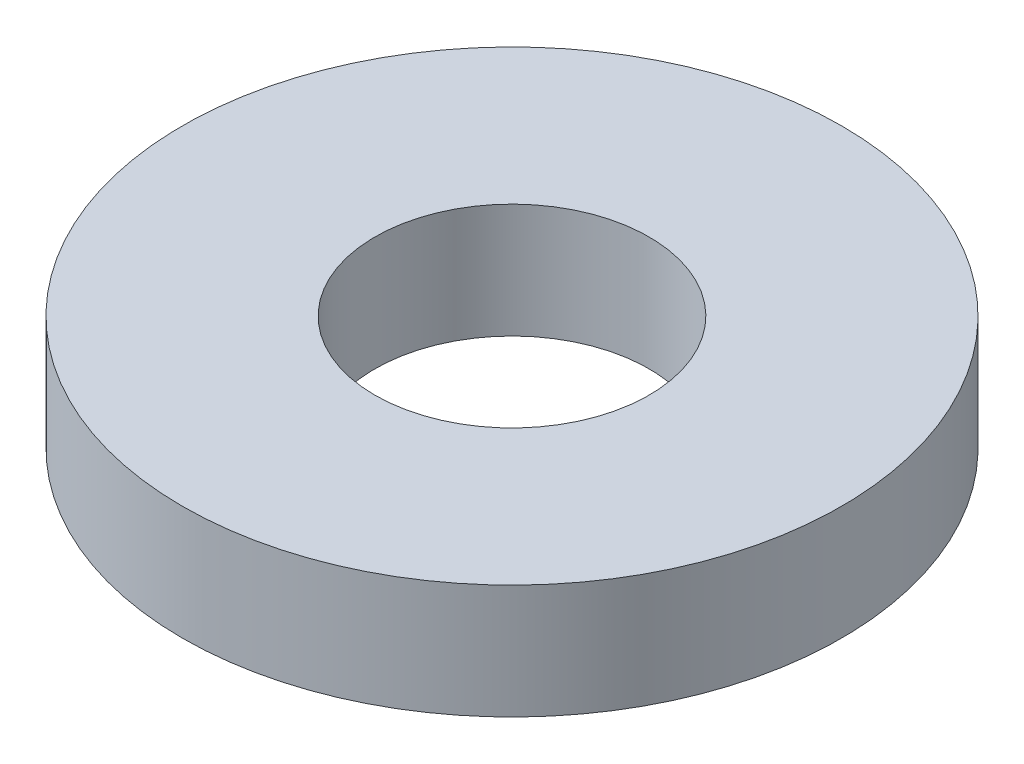
ISO-10303-21;
HEADER;
FILE_DESCRIPTION(('STEP AP214'),'2;1');
FILE_NAME('part.step','',(''),(''),'','','');
FILE_SCHEMA(('AUTOMOTIVE_DESIGN { 1 0 10303 214 1 1 1 1 }'));
ENDSEC;
DATA;
#1=APPLICATION_CONTEXT('core data for automotive mechanical design processes');
#2=APPLICATION_PROTOCOL_DEFINITION('international standard','automotive_design',2000,#1);
#3=PRODUCT_CONTEXT('',#1,'mechanical');
#4=PRODUCT('Part','Part','',(#3));
#5=PRODUCT_RELATED_PRODUCT_CATEGORY('part','',(#4));
#6=PRODUCT_DEFINITION_FORMATION('','',#4);
#7=PRODUCT_DEFINITION_CONTEXT('part definition',#1,'design');
#8=PRODUCT_DEFINITION('design','',#6,#7);
#9=PRODUCT_DEFINITION_SHAPE('','',#8);
#10=(LENGTH_UNIT() NAMED_UNIT(*) SI_UNIT(.MILLI.,.METRE.));
#11=(NAMED_UNIT(*) PLANE_ANGLE_UNIT() SI_UNIT($,.RADIAN.));
#12=(NAMED_UNIT(*) SI_UNIT($,.STERADIAN.) SOLID_ANGLE_UNIT());
#13=UNCERTAINTY_MEASURE_WITH_UNIT(LENGTH_MEASURE(1.E-05),#10,'distance_accuracy_value','');
#14=(GEOMETRIC_REPRESENTATION_CONTEXT(3) GLOBAL_UNCERTAINTY_ASSIGNED_CONTEXT((#13)) GLOBAL_UNIT_ASSIGNED_CONTEXT((#10,
#11,#12)) REPRESENTATION_CONTEXT('',''));
#15=CARTESIAN_POINT('',(0.,0.,0.));
#16=DIRECTION('',(0.,0.,1.));
#17=DIRECTION('',(1.,0.,0.));
#18=AXIS2_PLACEMENT_3D('',#15,#16,#17);
#19=CARTESIAN_POINT('',(0.,1.651,0.));
#20=DIRECTION('',(0.,-1.,0.));
#21=DIRECTION('',(0.,0.,-1.));
#22=AXIS2_PLACEMENT_3D('',#19,#20,#21);
#23=CYLINDRICAL_SURFACE('',#22,4.7625);
#24=CARTESIAN_POINT('',(0.,1.651,0.));
#25=DIRECTION('',(0.,1.,0.));
#26=DIRECTION('',(0.,0.,1.));
#27=AXIS2_PLACEMENT_3D('',#24,#25,#26);
#28=CIRCLE('',#27,4.7625);
#29=CARTESIAN_POINT('',(0.,1.651,4.7625));
#30=VERTEX_POINT('',#29);
#31=EDGE_CURVE('E10',#30,#30,#28,.T.);
#32=ORIENTED_EDGE('',*,*,#31,.F.);
#33=EDGE_LOOP('',(#32));
#34=FACE_BOUND('',#33,.T.);
#35=CARTESIAN_POINT('',(0.,0.,0.));
#36=DIRECTION('',(0.,1.,0.));
#37=DIRECTION('',(0.,0.,1.));
#38=AXIS2_PLACEMENT_3D('',#35,#36,#37);
#39=CIRCLE('',#38,4.7625);
#40=CARTESIAN_POINT('',(0.,0.,4.7625));
#41=VERTEX_POINT('',#40);
#42=EDGE_CURVE('E33',#41,#41,#39,.T.);
#43=ORIENTED_EDGE('',*,*,#42,.T.);
#44=EDGE_LOOP('',(#43));
#45=FACE_BOUND('',#44,.T.);
#46=ADVANCED_FACE('F30',(#34,#45),#23,.T.);
#47=CARTESIAN_POINT('',(0.,1.651,0.));
#48=DIRECTION('',(0.,1.,0.));
#49=DIRECTION('',(0.,0.,1.));
#50=AXIS2_PLACEMENT_3D('',#47,#48,#49);
#51=PLANE('',#50);
#52=CARTESIAN_POINT('',(0.,1.651,0.));
#53=DIRECTION('',(0.,1.,0.));
#54=DIRECTION('',(0.,0.,1.));
#55=AXIS2_PLACEMENT_3D('',#52,#53,#54);
#56=CIRCLE('',#55,1.9812);
#57=CARTESIAN_POINT('',(0.,1.651,1.9812));
#58=VERTEX_POINT('',#57);
#59=EDGE_CURVE('E42',#58,#58,#56,.T.);
#60=ORIENTED_EDGE('',*,*,#59,.F.);
#61=EDGE_LOOP('',(#60));
#62=FACE_BOUND('',#61,.T.);
#63=ORIENTED_EDGE('',*,*,#31,.T.);
#64=EDGE_LOOP('',(#63));
#65=FACE_BOUND('',#64,.T.);
#66=ADVANCED_FACE('F57',(#62,#65),#51,.T.);
#67=CARTESIAN_POINT('',(0.,0.,0.));
#68=DIRECTION('',(0.,1.,0.));
#69=DIRECTION('',(0.,0.,1.));
#70=AXIS2_PLACEMENT_3D('',#67,#68,#69);
#71=PLANE('',#70);
#72=CARTESIAN_POINT('',(0.,0.,0.));
#73=DIRECTION('',(0.,1.,0.));
#74=DIRECTION('',(0.,0.,1.));
#75=AXIS2_PLACEMENT_3D('',#72,#73,#74);
#76=CIRCLE('',#75,1.9812);
#77=CARTESIAN_POINT('',(0.,0.,1.9812));
#78=VERTEX_POINT('',#77);
#79=EDGE_CURVE('E40',#78,#78,#76,.T.);
#80=ORIENTED_EDGE('',*,*,#79,.T.);
#81=EDGE_LOOP('',(#80));
#82=FACE_BOUND('',#81,.T.);
#83=ORIENTED_EDGE('',*,*,#42,.F.);
#84=EDGE_LOOP('',(#83));
#85=FACE_BOUND('',#84,.T.);
#86=ADVANCED_FACE('F48',(#82,#85),#71,.F.);
#87=CARTESIAN_POINT('',(0.,0.,0.));
#88=DIRECTION('',(0.,1.,0.));
#89=DIRECTION('',(0.,0.,1.));
#90=AXIS2_PLACEMENT_3D('',#87,#88,#89);
#91=CYLINDRICAL_SURFACE('',#90,1.9812);
#92=ORIENTED_EDGE('',*,*,#79,.F.);
#93=EDGE_LOOP('',(#92));
#94=FACE_BOUND('',#93,.T.);
#95=ORIENTED_EDGE('',*,*,#59,.T.);
#96=EDGE_LOOP('',(#95));
#97=FACE_BOUND('',#96,.T.);
#98=ADVANCED_FACE('F51',(#94,#97),#91,.F.);
#99=CLOSED_SHELL('',(#46,#66,#86,#98));
#100=MANIFOLD_SOLID_BREP('B2',#99);
#101=ADVANCED_BREP_SHAPE_REPRESENTATION('',(#18,#100),#14);
#102=SHAPE_DEFINITION_REPRESENTATION(#9,#101);
ENDSEC;
END-ISO-10303-21;
